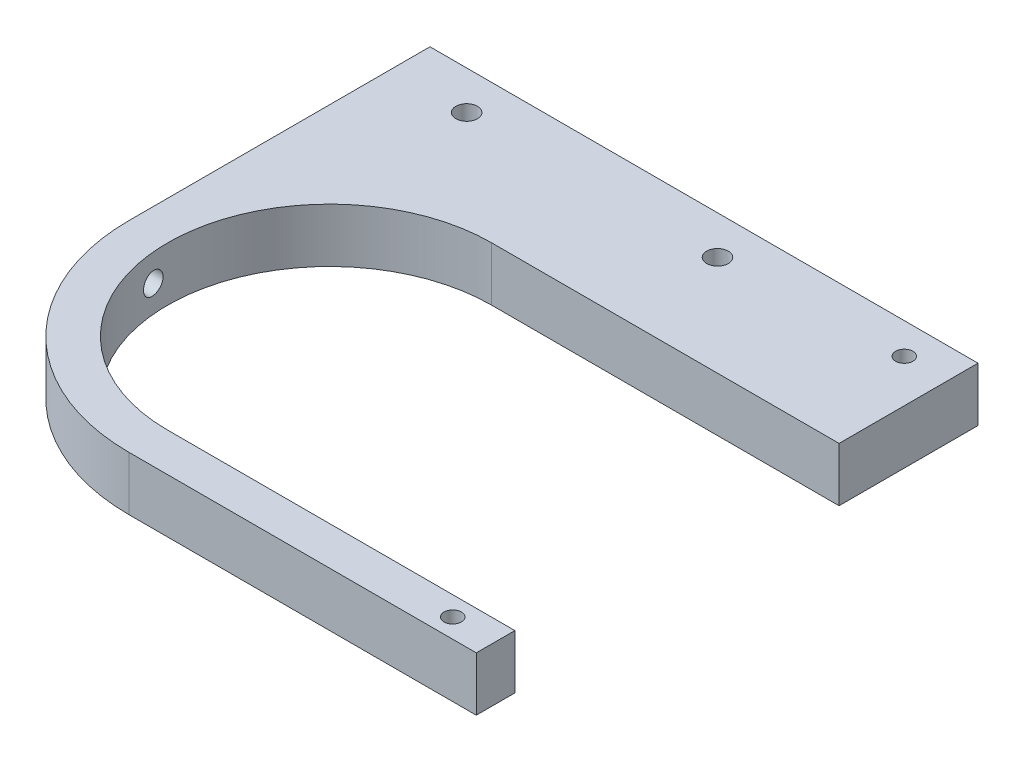
ISO-10303-21;
HEADER;
FILE_DESCRIPTION(('STEP AP214'),'2;1');
FILE_NAME('part.step','',(''),(''),'','','');
FILE_SCHEMA(('AUTOMOTIVE_DESIGN { 1 0 10303 214 1 1 1 1 }'));
ENDSEC;
DATA;
#1=APPLICATION_CONTEXT('core data for automotive mechanical design processes');
#2=APPLICATION_PROTOCOL_DEFINITION('international standard','automotive_design',2000,#1);
#3=PRODUCT_CONTEXT('',#1,'mechanical');
#4=PRODUCT('Part','Part','',(#3));
#5=PRODUCT_RELATED_PRODUCT_CATEGORY('part','',(#4));
#6=PRODUCT_DEFINITION_FORMATION('','',#4);
#7=PRODUCT_DEFINITION_CONTEXT('part definition',#1,'design');
#8=PRODUCT_DEFINITION('design','',#6,#7);
#9=PRODUCT_DEFINITION_SHAPE('','',#8);
#10=(LENGTH_UNIT() NAMED_UNIT(*) SI_UNIT(.MILLI.,.METRE.));
#11=(NAMED_UNIT(*) PLANE_ANGLE_UNIT() SI_UNIT($,.RADIAN.));
#12=(NAMED_UNIT(*) SI_UNIT($,.STERADIAN.) SOLID_ANGLE_UNIT());
#13=UNCERTAINTY_MEASURE_WITH_UNIT(LENGTH_MEASURE(1.E-05),#10,'distance_accuracy_value','');
#14=(GEOMETRIC_REPRESENTATION_CONTEXT(3) GLOBAL_UNCERTAINTY_ASSIGNED_CONTEXT((#13)) GLOBAL_UNIT_ASSIGNED_CONTEXT((#10,
#11,#12)) REPRESENTATION_CONTEXT('',''));
#15=CARTESIAN_POINT('',(0.,0.,0.));
#16=DIRECTION('',(0.,0.,1.));
#17=DIRECTION('',(1.,0.,0.));
#18=AXIS2_PLACEMENT_3D('',#15,#16,#17);
#19=CARTESIAN_POINT('',(0.,7.,0.));
#20=DIRECTION('',(0.,-1.,0.));
#21=DIRECTION('',(0.,0.,-1.));
#22=AXIS2_PLACEMENT_3D('',#19,#20,#21);
#23=CYLINDRICAL_SURFACE('',#22,21.);
#24=CARTESIAN_POINT('',(-20.7251903746368,3.5,3.38621971157564));
#25=CARTESIAN_POINT('',(-20.7251913471803,3.57796342783302,3.38621617307323));
#26=CARTESIAN_POINT('',(-20.7262614818687,3.65598157346017,3.37968411025061));
#27=CARTESIAN_POINT('',(-20.7304760100522,3.80984874992339,3.35373378688824));
#28=CARTESIAN_POINT('',(-20.7336228168622,3.88569514983167,3.3343005336295));
#29=CARTESIAN_POINT('',(-20.7417837122888,4.03295361898446,3.28315012719174));
#30=CARTESIAN_POINT('',(-20.7467962801919,4.10436924443581,3.25144297717662));
#31=CARTESIAN_POINT('',(-20.7583733047595,4.24083244334407,3.17669032323015));
#32=CARTESIAN_POINT('',(-20.7649374582461,4.30588125736108,3.13364703417879));
#33=CARTESIAN_POINT('',(-20.7792771403225,4.4283053464389,3.03710927350261));
#34=CARTESIAN_POINT('',(-20.7870609726795,4.48562259948695,2.98354246993105));
#35=CARTESIAN_POINT('',(-20.8033629311361,4.59048607000408,2.86766590992041));
#36=CARTESIAN_POINT('',(-20.8118811253355,4.63803137990189,2.80535534230596));
#37=CARTESIAN_POINT('',(-20.829294758453,4.72251772137512,2.6730085893298));
#38=CARTESIAN_POINT('',(-20.8381932573246,4.75933992218157,2.60289691695991));
#39=CARTESIAN_POINT('',(-20.855844488386,4.8206667822953,2.45746042812871));
#40=CARTESIAN_POINT('',(-20.8645972170034,4.84517114016135,2.38213548413997));
#41=CARTESIAN_POINT('',(-20.8816075718508,4.88121848847831,2.22811242356827));
#42=CARTESIAN_POINT('',(-20.8898633939771,4.8927166639148,2.14940360813372));
#43=CARTESIAN_POINT('',(-20.9055465115775,4.90223536372278,1.99109283876383));
#44=CARTESIAN_POINT('',(-20.9129738262562,4.90025620056153,1.91149090557783));
#45=CARTESIAN_POINT('',(-20.9267695521562,4.88286919128512,1.75400689402903));
#46=CARTESIAN_POINT('',(-20.9331421936006,4.86751661890114,1.67611908787106));
#47=CARTESIAN_POINT('',(-20.944768366594,4.82385549877339,1.52397577212139));
#48=CARTESIAN_POINT('',(-20.9500219325474,4.79554734941386,1.44972015091765));
#49=CARTESIAN_POINT('',(-20.9593828497396,4.72695820140345,1.30741439211239));
#50=CARTESIAN_POINT('',(-20.96349663822,4.68674721143296,1.23933092850062));
#51=CARTESIAN_POINT('',(-20.970697263797,4.59542259978396,1.1108566791854));
#52=CARTESIAN_POINT('',(-20.9737841180593,4.5443091603677,1.05046576490833));
#53=CARTESIAN_POINT('',(-20.9790572258145,4.43279498549526,0.939283756172083));
#54=CARTESIAN_POINT('',(-20.9812460785329,4.37242175904389,0.888465189256852));
#55=CARTESIAN_POINT('',(-20.9848945804997,4.24399229546418,0.797665942261616));
#56=CARTESIAN_POINT('',(-20.9863542311464,4.1759360730687,0.757685241399481));
#57=CARTESIAN_POINT('',(-20.988698355725,4.03409065743766,0.689712536197557));
#58=CARTESIAN_POINT('',(-20.9895829692353,3.96030286029556,0.661717623118196));
#59=CARTESIAN_POINT('',(-20.9909011129859,3.80907339384935,0.618499636176985));
#60=CARTESIAN_POINT('',(-20.9913346423304,3.73163171728884,0.603276587680539));
#61=CARTESIAN_POINT('',(-20.991823236802,3.57525877129235,0.586031823632448));
#62=CARTESIAN_POINT('',(-20.9918781464435,3.49632690322823,0.584015531646402));
#63=CARTESIAN_POINT('',(-20.991618987766,3.33924447574318,0.593256056009732));
#64=CARTESIAN_POINT('',(-20.9913049188839,3.26109391751493,0.604512892617455));
#65=CARTESIAN_POINT('',(-20.9902533306642,3.10778222312786,0.639981759419869));
#66=CARTESIAN_POINT('',(-20.9895157560947,3.03262147825643,0.664195479373712));
#67=CARTESIAN_POINT('',(-20.9875070539642,2.88743508273609,0.724889115546488));
#68=CARTESIAN_POINT('',(-20.9862359273903,2.81740942258874,0.761369009075825));
#69=CARTESIAN_POINT('',(-20.9830127305376,2.68449800356181,0.845543276095974));
#70=CARTESIAN_POINT('',(-20.9810608158909,2.62161061718389,0.893235085667863));
#71=CARTESIAN_POINT('',(-20.9763157189263,2.50474282453423,0.998471636092041));
#72=CARTESIAN_POINT('',(-20.9735225420564,2.45076236058522,1.05601631313664));
#73=CARTESIAN_POINT('',(-20.9669524446059,2.3532548843712,1.17928185481063));
#74=CARTESIAN_POINT('',(-20.9631759162246,2.30972371778707,1.24499945430967));
#75=CARTESIAN_POINT('',(-20.9545408260572,2.23430675237358,1.38274161288909));
#76=CARTESIAN_POINT('',(-20.9496822681237,2.202420912081,1.45476614951246));
#77=CARTESIAN_POINT('',(-20.9388525569206,2.15114996915116,1.60311713917561));
#78=CARTESIAN_POINT('',(-20.9328805515149,2.13177449188929,1.67944685560983));
#79=CARTESIAN_POINT('',(-20.9198898730644,2.10607137019401,1.83418485355518));
#80=CARTESIAN_POINT('',(-20.9128711778368,2.09974400233379,1.91259317908971));
#81=CARTESIAN_POINT('',(-20.897920325963,2.10027290504908,2.06958134192034));
#82=CARTESIAN_POINT('',(-20.8899847605712,2.10717996412416,2.14816067936248));
#83=CARTESIAN_POINT('',(-20.8734834419422,2.13404539096667,2.30298790253425));
#84=CARTESIAN_POINT('',(-20.8649176625526,2.15400430062721,2.37923569132391));
#85=CARTESIAN_POINT('',(-20.8474511812691,2.20655145084546,2.5277272881768));
#86=CARTESIAN_POINT('',(-20.8385487845881,2.23921440867713,2.59994446243285));
#87=CARTESIAN_POINT('',(-20.8208782696671,2.3162440881565,2.73785822347917));
#88=CARTESIAN_POINT('',(-20.812110150328,2.36061071394748,2.8035548636686));
#89=CARTESIAN_POINT('',(-20.7951459817752,2.45994963865638,2.92673633456874));
#90=CARTESIAN_POINT('',(-20.7869514291923,2.51494837088776,2.98420006356591));
#91=CARTESIAN_POINT('',(-20.7716258193298,2.63397246301998,3.08907393672213));
#92=CARTESIAN_POINT('',(-20.7644949904161,2.69799975549789,3.13648192297922));
#93=CARTESIAN_POINT('',(-20.7517695217233,2.83290281530044,3.2196002779026));
#94=CARTESIAN_POINT('',(-20.7461669312478,2.90374043977157,3.25537138275892));
#95=CARTESIAN_POINT('',(-20.7368120464188,3.05048441198586,3.31444255493363));
#96=CARTESIAN_POINT('',(-20.7330574283341,3.1263842570959,3.33775828741597));
#97=CARTESIAN_POINT('',(-20.7286429240355,3.25231523689511,3.36503613842597));
#98=CARTESIAN_POINT('',(-20.7273517146842,3.30149998126704,3.37296902759498));
#99=CARTESIAN_POINT('',(-20.7256251332601,3.40044904928513,3.38356192056292));
#100=CARTESIAN_POINT('',(-20.7251897535806,3.45021336777613,3.3862219712264));
#101=CARTESIAN_POINT('',(-20.7251903746368,3.5,3.38621971157564));
#102=B_SPLINE_CURVE_WITH_KNOTS('',3,(#24,#25,#26,#27,#28,#29,#30,#31,#32,#33,#34,#35,#36,#37,
#38,#39,#40,#41,#42,#43,#44,#45,#46,#47,#48,#49,#50,#51,#52,#53,#54,#55,#56,#57,#58,#59,#60,#61,
#62,#63,#64,#65,#66,#67,#68,#69,#70,#71,#72,#73,#74,#75,#76,#77,#78,#79,#80,#81,#82,#83,#84,#85,
#86,#87,#88,#89,#90,#91,#92,#93,#94,#95,#96,#97,#98,#99,#100,#101),.UNSPECIFIED.,.T.,.F.,(4,2,2,
2,2,2,2,2,2,2,2,2,2,2,2,2,2,2,2,2,2,2,2,2,2,2,2,2,2,2,2,2,2,2,2,2,2,2,4),(0.,0.233707286531613,
0.467686645297522,0.701475712187958,0.935219134695543,1.17062922389645,1.40606116698872,
1.64401064216007,1.8819659401278,2.12073867951511,2.35950588306096,2.59729089365765,
2.83506859285204,3.07147464569973,3.30787674672721,3.54358968101514,3.77930216330899,
4.01495740986626,4.25061312444261,4.48636560873954,4.72211845285831,4.9579020499474,
5.19368521089354,5.42941450576761,5.66514227410412,5.90077616853381,6.13640922397986,
6.3722233583024,6.60804249098877,6.84476841713518,7.08150417240864,7.31965384238491,
7.55780156190072,7.79654915591233,8.03534793200486,8.27287957057998,8.51011175723396,
8.6593561204268,8.80859915714277),.UNSPECIFIED.);
#103=CARTESIAN_POINT('',(-20.7251903746368,3.5,3.38621971157564));
#104=VERTEX_POINT('',#103);
#105=EDGE_CURVE('E211',#104,#104,#102,.T.);
#106=ORIENTED_EDGE('',*,*,#105,.T.);
#107=EDGE_LOOP('',(#106));
#108=FACE_BOUND('',#107,.T.);
#109=CARTESIAN_POINT('',(0.,0.,0.));
#110=DIRECTION('',(0.,-1.,0.));
#111=DIRECTION('',(0.,0.,1.));
#112=AXIS2_PLACEMENT_3D('',#109,#110,#111);
#113=CIRCLE('',#112,21.);
#114=CARTESIAN_POINT('',(0.,0.,21.));
#115=VERTEX_POINT('',#114);
#116=CARTESIAN_POINT('',(0.,0.,-21.));
#117=VERTEX_POINT('',#116);
#118=EDGE_CURVE('E141',#115,#117,#113,.T.);
#119=ORIENTED_EDGE('',*,*,#118,.T.);
#120=DIRECTION('',(0.,-1.,0.));
#121=VECTOR('',#120,1.);
#122=CARTESIAN_POINT('',(0.,7.,-21.));
#123=LINE('',#122,#121);
#124=CARTESIAN_POINT('',(0.,7.,-21.));
#125=VERTEX_POINT('',#124);
#126=EDGE_CURVE('E11',#125,#117,#123,.T.);
#127=ORIENTED_EDGE('',*,*,#126,.F.);
#128=CARTESIAN_POINT('',(0.,7.,0.));
#129=DIRECTION('',(0.,-1.,0.));
#130=DIRECTION('',(0.,0.,1.));
#131=AXIS2_PLACEMENT_3D('',#128,#129,#130);
#132=CIRCLE('',#131,21.);
#133=CARTESIAN_POINT('',(0.,7.,21.));
#134=VERTEX_POINT('',#133);
#135=EDGE_CURVE('E158',#134,#125,#132,.T.);
#136=ORIENTED_EDGE('',*,*,#135,.F.);
#137=DIRECTION('',(0.,-1.,0.));
#138=VECTOR('',#137,1.);
#139=CARTESIAN_POINT('',(0.,7.,21.));
#140=LINE('',#139,#138);
#141=EDGE_CURVE('E137',#134,#115,#140,.T.);
#142=ORIENTED_EDGE('',*,*,#141,.T.);
#143=EDGE_LOOP('',(#119,#127,#136,#142));
#144=FACE_BOUND('',#143,.T.);
#145=ADVANCED_FACE('F33',(#108,#144),#23,.F.);
#146=CARTESIAN_POINT('',(0.,7.,-21.));
#147=DIRECTION('',(0.,0.,-1.));
#148=DIRECTION('',(-1.,0.,0.));
#149=AXIS2_PLACEMENT_3D('',#146,#147,#148);
#150=PLANE('',#149);
#151=DIRECTION('',(1.,0.,0.));
#152=VECTOR('',#151,1.);
#153=CARTESIAN_POINT('',(0.,0.,-21.));
#154=LINE('',#153,#152);
#155=CARTESIAN_POINT('',(45.,0.,-21.));
#156=VERTEX_POINT('',#155);
#157=EDGE_CURVE('E144',#117,#156,#154,.T.);
#158=ORIENTED_EDGE('',*,*,#157,.T.);
#159=DIRECTION('',(0.,-1.,0.));
#160=VECTOR('',#159,1.);
#161=CARTESIAN_POINT('',(45.,7.,-21.));
#162=LINE('',#161,#160);
#163=CARTESIAN_POINT('',(45.,7.,-21.));
#164=VERTEX_POINT('',#163);
#165=EDGE_CURVE('E47',#164,#156,#162,.T.);
#166=ORIENTED_EDGE('',*,*,#165,.F.);
#167=DIRECTION('',(1.,0.,0.));
#168=VECTOR('',#167,1.);
#169=CARTESIAN_POINT('',(0.,7.,-21.));
#170=LINE('',#169,#168);
#171=EDGE_CURVE('E101',#125,#164,#170,.T.);
#172=ORIENTED_EDGE('',*,*,#171,.F.);
#173=ORIENTED_EDGE('',*,*,#126,.T.);
#174=EDGE_LOOP('',(#158,#166,#172,#173));
#175=FACE_BOUND('',#174,.T.);
#176=ADVANCED_FACE('F257',(#175),#150,.F.);
#177=CARTESIAN_POINT('',(45.,7.,-21.));
#178=DIRECTION('',(-1.,0.,0.));
#179=DIRECTION('',(0.,0.,1.));
#180=AXIS2_PLACEMENT_3D('',#177,#178,#179);
#181=PLANE('',#180);
#182=DIRECTION('',(0.,0.,-1.));
#183=VECTOR('',#182,1.);
#184=CARTESIAN_POINT('',(45.,0.,-21.));
#185=LINE('',#184,#183);
#186=CARTESIAN_POINT('',(45.,0.,-39.));
#187=VERTEX_POINT('',#186);
#188=EDGE_CURVE('E147',#156,#187,#185,.T.);
#189=ORIENTED_EDGE('',*,*,#188,.T.);
#190=DIRECTION('',(0.,-1.,0.));
#191=VECTOR('',#190,1.);
#192=CARTESIAN_POINT('',(45.,7.,-39.));
#193=LINE('',#192,#191);
#194=CARTESIAN_POINT('',(45.,7.,-39.));
#195=VERTEX_POINT('',#194);
#196=EDGE_CURVE('E168',#195,#187,#193,.T.);
#197=ORIENTED_EDGE('',*,*,#196,.F.);
#198=DIRECTION('',(0.,0.,-1.));
#199=VECTOR('',#198,1.);
#200=CARTESIAN_POINT('',(45.,7.,-21.));
#201=LINE('',#200,#199);
#202=EDGE_CURVE('E177',#164,#195,#201,.T.);
#203=ORIENTED_EDGE('',*,*,#202,.F.);
#204=ORIENTED_EDGE('',*,*,#165,.T.);
#205=EDGE_LOOP('',(#189,#197,#203,#204));
#206=FACE_BOUND('',#205,.T.);
#207=ADVANCED_FACE('F175',(#206),#181,.F.);
#208=CARTESIAN_POINT('',(45.,7.,-39.));
#209=DIRECTION('',(0.,0.,1.));
#210=DIRECTION('',(1.,0.,0.));
#211=AXIS2_PLACEMENT_3D('',#208,#209,#210);
#212=PLANE('',#211);
#213=DIRECTION('',(-1.,0.,0.));
#214=VECTOR('',#213,1.);
#215=CARTESIAN_POINT('',(45.,0.,-39.));
#216=LINE('',#215,#214);
#217=CARTESIAN_POINT('',(-26.,0.,-39.));
#218=VERTEX_POINT('',#217);
#219=EDGE_CURVE('E149',#187,#218,#216,.T.);
#220=ORIENTED_EDGE('',*,*,#219,.T.);
#221=DIRECTION('',(0.,-1.,0.));
#222=VECTOR('',#221,1.);
#223=CARTESIAN_POINT('',(-26.,7.,-39.));
#224=LINE('',#223,#222);
#225=CARTESIAN_POINT('',(-26.,7.,-39.));
#226=VERTEX_POINT('',#225);
#227=EDGE_CURVE('E165',#226,#218,#224,.T.);
#228=ORIENTED_EDGE('',*,*,#227,.F.);
#229=DIRECTION('',(-1.,0.,0.));
#230=VECTOR('',#229,1.);
#231=CARTESIAN_POINT('',(45.,7.,-39.));
#232=LINE('',#231,#230);
#233=EDGE_CURVE('E193',#195,#226,#232,.T.);
#234=ORIENTED_EDGE('',*,*,#233,.F.);
#235=ORIENTED_EDGE('',*,*,#196,.T.);
#236=EDGE_LOOP('',(#220,#228,#234,#235));
#237=FACE_BOUND('',#236,.T.);
#238=ADVANCED_FACE('F186',(#237),#212,.F.);
#239=CARTESIAN_POINT('',(-26.,7.,-39.));
#240=DIRECTION('',(1.,0.,0.));
#241=DIRECTION('',(0.,0.,-1.));
#242=AXIS2_PLACEMENT_3D('',#239,#240,#241);
#243=PLANE('',#242);
#244=DIRECTION('',(0.,0.,1.));
#245=VECTOR('',#244,1.);
#246=CARTESIAN_POINT('',(-26.,0.,-39.));
#247=LINE('',#246,#245);
#248=CARTESIAN_POINT('',(-26.,0.,0.));
#249=VERTEX_POINT('',#248);
#250=EDGE_CURVE('E151',#218,#249,#247,.T.);
#251=ORIENTED_EDGE('',*,*,#250,.T.);
#252=DIRECTION('',(0.,-1.,0.));
#253=VECTOR('',#252,1.);
#254=CARTESIAN_POINT('',(-26.,7.,0.));
#255=LINE('',#254,#253);
#256=CARTESIAN_POINT('',(-26.,7.,0.));
#257=VERTEX_POINT('',#256);
#258=EDGE_CURVE('E162',#257,#249,#255,.T.);
#259=ORIENTED_EDGE('',*,*,#258,.F.);
#260=DIRECTION('',(0.,0.,1.));
#261=VECTOR('',#260,1.);
#262=CARTESIAN_POINT('',(-26.,7.,-39.));
#263=LINE('',#262,#261);
#264=EDGE_CURVE('E192',#226,#257,#263,.T.);
#265=ORIENTED_EDGE('',*,*,#264,.F.);
#266=ORIENTED_EDGE('',*,*,#227,.T.);
#267=EDGE_LOOP('',(#251,#259,#265,#266));
#268=FACE_BOUND('',#267,.T.);
#269=ADVANCED_FACE('F190',(#268),#243,.F.);
#270=CARTESIAN_POINT('',(0.,7.,0.));
#271=DIRECTION('',(0.,-1.,0.));
#272=DIRECTION('',(0.,0.,-1.));
#273=AXIS2_PLACEMENT_3D('',#270,#271,#272);
#274=CYLINDRICAL_SURFACE('',#273,26.);
#275=CARTESIAN_POINT('',(-25.7785475941709,3.5,3.38621971157565));
#276=CARTESIAN_POINT('',(-25.7785483766418,3.42180120053282,3.38621618939366));
#277=CARTESIAN_POINT('',(-25.7794138721171,3.3435468851804,3.37964504287734));
#278=CARTESIAN_POINT('',(-25.7828233362631,3.18920671408434,3.35353356124606));
#279=CARTESIAN_POINT('',(-25.78536928071,3.11312352100758,3.33397795958713));
#280=CARTESIAN_POINT('',(-25.7919745732873,2.96539289153677,3.2824864264792));
#281=CARTESIAN_POINT('',(-25.7960328665033,2.89374240370692,3.25055912409291));
#282=CARTESIAN_POINT('',(-25.805409045951,2.75684574886473,3.17526320143853));
#283=CARTESIAN_POINT('',(-25.8107266631365,2.69159821810903,3.13189702478436));
#284=CARTESIAN_POINT('',(-25.8223315076793,2.56899511768306,3.03473122047407));
#285=CARTESIAN_POINT('',(-25.8286231645064,2.51167798693093,2.9808836251039));
#286=CARTESIAN_POINT('',(-25.8417994961178,2.40687335683891,2.86440696447606));
#287=CARTESIAN_POINT('',(-25.8486842150409,2.3593865900242,2.80177724538736));
#288=CARTESIAN_POINT('',(-25.8627296714838,2.27525719397023,2.66902470426923));
#289=CARTESIAN_POINT('',(-25.8698919921057,2.23869205446959,2.59885292865906));
#290=CARTESIAN_POINT('',(-25.884095810183,2.17787757984204,2.45334922104215));
#291=CARTESIAN_POINT('',(-25.8911373058337,2.1536284285146,2.37801721204495));
#292=CARTESIAN_POINT('',(-25.9048099525487,2.11810179039603,2.22413963226097));
#293=CARTESIAN_POINT('',(-25.9114401628081,2.10685307614408,2.14558733035552));
#294=CARTESIAN_POINT('',(-25.9240330841033,2.09776830837959,1.98765755336474));
#295=CARTESIAN_POINT('',(-25.9299958055942,2.09993204475278,1.9082800912255));
#296=CARTESIAN_POINT('',(-25.9410782653281,2.11761467465942,1.75118363504367));
#297=CARTESIAN_POINT('',(-25.9462002282477,2.13309762389078,1.67346075380371));
#298=CARTESIAN_POINT('',(-25.9555439170031,2.17695551111992,1.52168473295721));
#299=CARTESIAN_POINT('',(-25.9597656604072,2.20533019749404,1.44763152175655));
#300=CARTESIAN_POINT('',(-25.9672959173002,2.27404910741945,1.30559856826506));
#301=CARTESIAN_POINT('',(-25.9706077960816,2.31434804551426,1.23759709153424));
#302=CARTESIAN_POINT('',(-25.976403973758,2.40581832517101,1.10930899678509));
#303=CARTESIAN_POINT('',(-25.9788882817331,2.45698954743058,1.04902229412361));
#304=CARTESIAN_POINT('',(-25.9831338390139,2.56864514866346,0.937999876083232));
#305=CARTESIAN_POINT('',(-25.9848964458243,2.62911174566992,0.887246327324683));
#306=CARTESIAN_POINT('',(-25.9878335808965,2.75771281077425,0.796598551502833));
#307=CARTESIAN_POINT('',(-25.9890081098471,2.8258472698906,0.756704311719992));
#308=CARTESIAN_POINT('',(-25.9908935516404,2.96783841655858,0.688917789769116));
#309=CARTESIAN_POINT('',(-25.9916045358146,3.0416942217369,0.661023661218064));
#310=CARTESIAN_POINT('',(-25.9926627228433,3.19304138490978,0.618021916194056));
#311=CARTESIAN_POINT('',(-25.9930099252315,3.27053274756206,0.602914316103146));
#312=CARTESIAN_POINT('',(-25.9933987804093,3.42697349175572,0.58591279115545));
#313=CARTESIAN_POINT('',(-25.9934403513843,3.5059232580272,0.584022404418312));
#314=CARTESIAN_POINT('',(-25.9932252238211,3.66301991012601,0.593518414859418));
#315=CARTESIAN_POINT('',(-25.9929685249829,3.74116679514555,0.604904825394491));
#316=CARTESIAN_POINT('',(-25.9921123866061,3.89444598408974,0.640632253536637));
#317=CARTESIAN_POINT('',(-25.9915129182699,3.96957803415605,0.664974359601638));
#318=CARTESIAN_POINT('',(-25.9898819256183,4.11468697102585,0.725921068468806));
#319=CARTESIAN_POINT('',(-25.9888504018504,4.18466386436208,0.762525655731296));
#320=CARTESIAN_POINT('',(-25.9862358980087,4.31746490442398,0.846947588624285));
#321=CARTESIAN_POINT('',(-25.9846530007921,4.38029012398143,0.894763249165791));
#322=CARTESIAN_POINT('',(-25.980806142006,4.49701632920238,1.00024495229973));
#323=CARTESIAN_POINT('',(-25.9785421832247,4.55091735139989,1.05791095456473));
#324=CARTESIAN_POINT('',(-25.973217751958,4.64825597021166,1.18142815356529));
#325=CARTESIAN_POINT('',(-25.9701574858115,4.69169627179841,1.2472772276));
#326=CARTESIAN_POINT('',(-25.9631612601743,4.76690889280093,1.38528882668179));
#327=CARTESIAN_POINT('',(-25.959225303034,4.79868124353288,1.45745133478329));
#328=CARTESIAN_POINT('',(-25.950454431124,4.84968882711792,1.60606786605304));
#329=CARTESIAN_POINT('',(-25.9456190590785,4.86891766014788,1.68252405832888));
#330=CARTESIAN_POINT('',(-25.935102679967,4.89429399437154,1.83752023626909));
#331=CARTESIAN_POINT('',(-25.9294216605081,4.90044130383638,1.91606025245786));
#332=CARTESIAN_POINT('',(-25.9173310777311,4.89950815269497,2.07320415829646));
#333=CARTESIAN_POINT('',(-25.9109197124388,4.89239427890378,2.15180770914051));
#334=CARTESIAN_POINT('',(-25.8975930066555,4.86509883483279,2.30666846953665));
#335=CARTESIAN_POINT('',(-25.8906776520431,4.84491689827364,2.38292561325951));
#336=CARTESIAN_POINT('',(-25.8765985159871,4.79196264961,2.53124962372817));
#337=CARTESIAN_POINT('',(-25.8694338718932,4.75914160795969,2.60329901390306));
#338=CARTESIAN_POINT('',(-25.8552217778792,4.68184078206336,2.74085647739015));
#339=CARTESIAN_POINT('',(-25.8481743256673,4.63736122610646,2.8063646787528));
#340=CARTESIAN_POINT('',(-25.8345557029291,4.53790530075151,2.92908794699194));
#341=CARTESIAN_POINT('',(-25.827985287301,4.48291277376828,2.9862900067306));
#342=CARTESIAN_POINT('',(-25.8157053099963,4.36399539829269,3.09065178127657));
#343=CARTESIAN_POINT('',(-25.8099959431909,4.30006853408385,3.13780922379502));
#344=CARTESIAN_POINT('',(-25.7998025197506,4.16533168341433,3.22054768617938));
#345=CARTESIAN_POINT('',(-25.7953144333848,4.09454540518268,3.25616685363571));
#346=CARTESIAN_POINT('',(-25.7878256971992,3.94797315667752,3.31495590459171));
#347=CARTESIAN_POINT('',(-25.7848232105121,3.87219349257375,3.33814116496729));
#348=CARTESIAN_POINT('',(-25.7812990748232,3.74660359593704,3.36522225220424));
#349=CARTESIAN_POINT('',(-25.7802699859931,3.69762737865138,3.37308581057756));
#350=CARTESIAN_POINT('',(-25.7788939996098,3.59910820659255,3.38358564177872));
#351=CARTESIAN_POINT('',(-25.7785470982123,3.54956525501462,3.38622194406322));
#352=CARTESIAN_POINT('',(-25.7785475941709,3.5,3.38621971157565));
#353=B_SPLINE_CURVE_WITH_KNOTS('',3,(#275,#276,#277,#278,#279,#280,#281,#282,#283,#284,#285,
#286,#287,#288,#289,#290,#291,#292,#293,#294,#295,#296,#297,#298,#299,#300,#301,#302,#303,#304,
#305,#306,#307,#308,#309,#310,#311,#312,#313,#314,#315,#316,#317,#318,#319,#320,#321,#322,#323,
#324,#325,#326,#327,#328,#329,#330,#331,#332,#333,#334,#335,#336,#337,#338,#339,#340,#341,#342,
#343,#344,#345,#346,#347,#348,#349,#350,#351,#352),.UNSPECIFIED.,.T.,.F.,(4,2,2,2,2,2,2,2,2,2,2,
2,2,2,2,2,2,2,2,2,2,2,2,2,2,2,2,2,2,2,2,2,2,2,2,2,2,2,4),(0.,0.234414665918658,
0.469105435369621,0.703632805566987,0.938110115692735,1.1736868605148,1.40928115339831,
1.646509329678,1.88374104616337,2.12149680395719,2.35924883717077,2.59636125921099,
2.83346905343921,3.06968768033945,3.30590371532922,3.54167336880475,3.77744274612143,
4.01317583407418,4.24890922404674,4.48470571514319,4.72050244345769,4.95631898509213,
5.19213522788829,5.4279160488391,5.66369590452336,5.89941472573769,6.13513291428998,
6.37097127465537,6.6068130915533,6.84324994429534,7.07969342431532,7.31705777968598,
7.55441748749585,7.79214497422779,8.02992618258459,8.26691302416587,8.50360610690051,
8.65218752054895,8.80076809690809),.UNSPECIFIED.);
#354=CARTESIAN_POINT('',(-25.7785475941709,3.5,3.38621971157565));
#355=VERTEX_POINT('',#354);
#356=EDGE_CURVE('E37',#355,#355,#353,.T.);
#357=ORIENTED_EDGE('',*,*,#356,.T.);
#358=EDGE_LOOP('',(#357));
#359=FACE_BOUND('',#358,.T.);
#360=CARTESIAN_POINT('',(0.,0.,0.));
#361=DIRECTION('',(0.,1.,0.));
#362=DIRECTION('',(0.,0.,1.));
#363=AXIS2_PLACEMENT_3D('',#360,#361,#362);
#364=CIRCLE('',#363,26.);
#365=CARTESIAN_POINT('',(0.,0.,26.));
#366=VERTEX_POINT('',#365);
#367=EDGE_CURVE('E153',#249,#366,#364,.T.);
#368=ORIENTED_EDGE('',*,*,#367,.T.);
#369=DIRECTION('',(0.,-1.,0.));
#370=VECTOR('',#369,1.);
#371=CARTESIAN_POINT('',(0.,7.,26.));
#372=LINE('',#371,#370);
#373=CARTESIAN_POINT('',(0.,7.,26.));
#374=VERTEX_POINT('',#373);
#375=EDGE_CURVE('E132',#374,#366,#372,.T.);
#376=ORIENTED_EDGE('',*,*,#375,.F.);
#377=CARTESIAN_POINT('',(0.,7.,0.));
#378=DIRECTION('',(0.,1.,0.));
#379=DIRECTION('',(0.,0.,1.));
#380=AXIS2_PLACEMENT_3D('',#377,#378,#379);
#381=CIRCLE('',#380,26.);
#382=EDGE_CURVE('E123',#257,#374,#381,.T.);
#383=ORIENTED_EDGE('',*,*,#382,.F.);
#384=ORIENTED_EDGE('',*,*,#258,.T.);
#385=EDGE_LOOP('',(#368,#376,#383,#384));
#386=FACE_BOUND('',#385,.T.);
#387=ADVANCED_FACE('F247',(#359,#386),#274,.T.);
#388=CARTESIAN_POINT('',(0.,7.,26.));
#389=DIRECTION('',(0.,0.,-1.));
#390=DIRECTION('',(-1.,0.,0.));
#391=AXIS2_PLACEMENT_3D('',#388,#389,#390);
#392=PLANE('',#391);
#393=DIRECTION('',(1.,0.,0.));
#394=VECTOR('',#393,1.);
#395=CARTESIAN_POINT('',(0.,0.,26.));
#396=LINE('',#395,#394);
#397=CARTESIAN_POINT('',(45.,0.,26.));
#398=VERTEX_POINT('',#397);
#399=EDGE_CURVE('E131',#366,#398,#396,.T.);
#400=ORIENTED_EDGE('',*,*,#399,.T.);
#401=DIRECTION('',(0.,-1.,0.));
#402=VECTOR('',#401,1.);
#403=CARTESIAN_POINT('',(45.,7.,26.));
#404=LINE('',#403,#402);
#405=CARTESIAN_POINT('',(45.,7.,26.));
#406=VERTEX_POINT('',#405);
#407=EDGE_CURVE('E128',#406,#398,#404,.T.);
#408=ORIENTED_EDGE('',*,*,#407,.F.);
#409=DIRECTION('',(1.,0.,0.));
#410=VECTOR('',#409,1.);
#411=CARTESIAN_POINT('',(0.,7.,26.));
#412=LINE('',#411,#410);
#413=EDGE_CURVE('E117',#374,#406,#412,.T.);
#414=ORIENTED_EDGE('',*,*,#413,.F.);
#415=ORIENTED_EDGE('',*,*,#375,.T.);
#416=EDGE_LOOP('',(#400,#408,#414,#415));
#417=FACE_BOUND('',#416,.T.);
#418=ADVANCED_FACE('F129',(#417),#392,.F.);
#419=CARTESIAN_POINT('',(45.,7.,26.));
#420=DIRECTION('',(-1.,0.,0.));
#421=DIRECTION('',(0.,0.,1.));
#422=AXIS2_PLACEMENT_3D('',#419,#420,#421);
#423=PLANE('',#422);
#424=DIRECTION('',(0.,0.,-1.));
#425=VECTOR('',#424,1.);
#426=CARTESIAN_POINT('',(45.,0.,26.));
#427=LINE('',#426,#425);
#428=CARTESIAN_POINT('',(45.,0.,21.));
#429=VERTEX_POINT('',#428);
#430=EDGE_CURVE('E87',#398,#429,#427,.T.);
#431=ORIENTED_EDGE('',*,*,#430,.T.);
#432=DIRECTION('',(0.,-1.,0.));
#433=VECTOR('',#432,1.);
#434=CARTESIAN_POINT('',(45.,7.,21.));
#435=LINE('',#434,#433);
#436=CARTESIAN_POINT('',(45.,7.,21.));
#437=VERTEX_POINT('',#436);
#438=EDGE_CURVE('E133',#437,#429,#435,.T.);
#439=ORIENTED_EDGE('',*,*,#438,.F.);
#440=DIRECTION('',(0.,0.,-1.));
#441=VECTOR('',#440,1.);
#442=CARTESIAN_POINT('',(45.,7.,26.));
#443=LINE('',#442,#441);
#444=EDGE_CURVE('E121',#406,#437,#443,.T.);
#445=ORIENTED_EDGE('',*,*,#444,.F.);
#446=ORIENTED_EDGE('',*,*,#407,.T.);
#447=EDGE_LOOP('',(#431,#439,#445,#446));
#448=FACE_BOUND('',#447,.T.);
#449=ADVANCED_FACE('F135',(#448),#423,.F.);
#450=CARTESIAN_POINT('',(0.,7.,21.));
#451=DIRECTION('',(0.,0.,1.));
#452=DIRECTION('',(1.,0.,0.));
#453=AXIS2_PLACEMENT_3D('',#450,#451,#452);
#454=PLANE('',#453);
#455=DIRECTION('',(-1.,0.,0.));
#456=VECTOR('',#455,1.);
#457=CARTESIAN_POINT('',(0.,0.,21.));
#458=LINE('',#457,#456);
#459=EDGE_CURVE('E93',#429,#115,#458,.T.);
#460=ORIENTED_EDGE('',*,*,#459,.T.);
#461=ORIENTED_EDGE('',*,*,#141,.F.);
#462=DIRECTION('',(-1.,0.,0.));
#463=VECTOR('',#462,1.);
#464=CARTESIAN_POINT('',(0.,7.,21.));
#465=LINE('',#464,#463);
#466=EDGE_CURVE('E55',#437,#134,#465,.T.);
#467=ORIENTED_EDGE('',*,*,#466,.F.);
#468=ORIENTED_EDGE('',*,*,#438,.T.);
#469=EDGE_LOOP('',(#460,#461,#467,#468));
#470=FACE_BOUND('',#469,.T.);
#471=ADVANCED_FACE('F237',(#470),#454,.F.);
#472=CARTESIAN_POINT('',(0.,7.,0.));
#473=DIRECTION('',(0.,1.,0.));
#474=DIRECTION('',(0.,0.,1.));
#475=AXIS2_PLACEMENT_3D('',#472,#473,#474);
#476=PLANE('',#475);
#477=CARTESIAN_POINT('',(-16.25,7.,-34.));
#478=DIRECTION('',(0.,1.,0.));
#479=DIRECTION('',(0.,0.,1.));
#480=AXIS2_PLACEMENT_3D('',#477,#478,#479);
#481=CIRCLE('',#480,1.4);
#482=CARTESIAN_POINT('',(-16.25,7.,-32.6));
#483=VERTEX_POINT('',#482);
#484=EDGE_CURVE('E331',#483,#483,#481,.T.);
#485=ORIENTED_EDGE('',*,*,#484,.F.);
#486=EDGE_LOOP('',(#485));
#487=FACE_BOUND('',#486,.T.);
#488=CARTESIAN_POINT('',(16.25,7.,-34.));
#489=DIRECTION('',(0.,1.,0.));
#490=DIRECTION('',(0.,0.,1.));
#491=AXIS2_PLACEMENT_3D('',#488,#489,#490);
#492=CIRCLE('',#491,1.4);
#493=CARTESIAN_POINT('',(16.25,7.,-32.6));
#494=VERTEX_POINT('',#493);
#495=EDGE_CURVE('E216',#494,#494,#492,.T.);
#496=ORIENTED_EDGE('',*,*,#495,.F.);
#497=EDGE_LOOP('',(#496));
#498=FACE_BOUND('',#497,.T.);
#499=CARTESIAN_POINT('',(39.4457939001427,7.,23.5));
#500=DIRECTION('',(0.,1.,0.));
#501=DIRECTION('',(0.,0.,1.));
#502=AXIS2_PLACEMENT_3D('',#499,#500,#501);
#503=CIRCLE('',#502,1.125);
#504=CARTESIAN_POINT('',(39.4457939001427,7.,24.625));
#505=VERTEX_POINT('',#504);
#506=EDGE_CURVE('E205',#505,#505,#503,.T.);
#507=ORIENTED_EDGE('',*,*,#506,.F.);
#508=EDGE_LOOP('',(#507));
#509=FACE_BOUND('',#508,.T.);
#510=CARTESIAN_POINT('',(39.4457939001427,7.,-35.));
#511=DIRECTION('',(0.,1.,0.));
#512=DIRECTION('',(0.,0.,1.));
#513=AXIS2_PLACEMENT_3D('',#510,#511,#512);
#514=CIRCLE('',#513,1.125);
#515=CARTESIAN_POINT('',(39.4457939001427,7.,-33.875));
#516=VERTEX_POINT('',#515);
#517=EDGE_CURVE('E145',#516,#516,#514,.T.);
#518=ORIENTED_EDGE('',*,*,#517,.F.);
#519=EDGE_LOOP('',(#518));
#520=FACE_BOUND('',#519,.T.);
#521=ORIENTED_EDGE('',*,*,#135,.T.);
#522=ORIENTED_EDGE('',*,*,#171,.T.);
#523=ORIENTED_EDGE('',*,*,#202,.T.);
#524=ORIENTED_EDGE('',*,*,#233,.T.);
#525=ORIENTED_EDGE('',*,*,#264,.T.);
#526=ORIENTED_EDGE('',*,*,#382,.T.);
#527=ORIENTED_EDGE('',*,*,#413,.T.);
#528=ORIENTED_EDGE('',*,*,#444,.T.);
#529=ORIENTED_EDGE('',*,*,#466,.T.);
#530=EDGE_LOOP('',(#521,#522,#523,#524,#525,#526,#527,#528,#529));
#531=FACE_BOUND('',#530,.T.);
#532=ADVANCED_FACE('F119',(#487,#498,#509,#520,#531),#476,.T.);
#533=CARTESIAN_POINT('',(0.,0.,0.));
#534=DIRECTION('',(0.,1.,0.));
#535=DIRECTION('',(0.,0.,1.));
#536=AXIS2_PLACEMENT_3D('',#533,#534,#535);
#537=PLANE('',#536);
#538=CARTESIAN_POINT('',(-16.25,0.,-34.));
#539=DIRECTION('',(0.,1.,0.));
#540=DIRECTION('',(0.,0.,1.));
#541=AXIS2_PLACEMENT_3D('',#538,#539,#540);
#542=CIRCLE('',#541,1.4);
#543=CARTESIAN_POINT('',(-16.25,0.,-32.6));
#544=VERTEX_POINT('',#543);
#545=EDGE_CURVE('E328',#544,#544,#542,.T.);
#546=ORIENTED_EDGE('',*,*,#545,.T.);
#547=EDGE_LOOP('',(#546));
#548=FACE_BOUND('',#547,.T.);
#549=CARTESIAN_POINT('',(16.25,0.,-34.));
#550=DIRECTION('',(0.,1.,0.));
#551=DIRECTION('',(0.,0.,1.));
#552=AXIS2_PLACEMENT_3D('',#549,#550,#551);
#553=CIRCLE('',#552,1.4);
#554=CARTESIAN_POINT('',(16.25,0.,-32.6));
#555=VERTEX_POINT('',#554);
#556=EDGE_CURVE('E334',#555,#555,#553,.T.);
#557=ORIENTED_EDGE('',*,*,#556,.T.);
#558=EDGE_LOOP('',(#557));
#559=FACE_BOUND('',#558,.T.);
#560=CARTESIAN_POINT('',(39.4457939001427,0.,23.5));
#561=DIRECTION('',(0.,1.,0.));
#562=DIRECTION('',(0.,0.,1.));
#563=AXIS2_PLACEMENT_3D('',#560,#561,#562);
#564=CIRCLE('',#563,1.125);
#565=CARTESIAN_POINT('',(39.4457939001427,0.,24.625));
#566=VERTEX_POINT('',#565);
#567=EDGE_CURVE('E208',#566,#566,#564,.T.);
#568=ORIENTED_EDGE('',*,*,#567,.T.);
#569=EDGE_LOOP('',(#568));
#570=FACE_BOUND('',#569,.T.);
#571=CARTESIAN_POINT('',(39.4457939001427,0.,-35.));
#572=DIRECTION('',(0.,1.,0.));
#573=DIRECTION('',(0.,0.,1.));
#574=AXIS2_PLACEMENT_3D('',#571,#572,#573);
#575=CIRCLE('',#574,1.125);
#576=CARTESIAN_POINT('',(39.4457939001427,0.,-33.875));
#577=VERTEX_POINT('',#576);
#578=EDGE_CURVE('E202',#577,#577,#575,.T.);
#579=ORIENTED_EDGE('',*,*,#578,.T.);
#580=EDGE_LOOP('',(#579));
#581=FACE_BOUND('',#580,.T.);
#582=ORIENTED_EDGE('',*,*,#118,.F.);
#583=ORIENTED_EDGE('',*,*,#459,.F.);
#584=ORIENTED_EDGE('',*,*,#430,.F.);
#585=ORIENTED_EDGE('',*,*,#399,.F.);
#586=ORIENTED_EDGE('',*,*,#367,.F.);
#587=ORIENTED_EDGE('',*,*,#250,.F.);
#588=ORIENTED_EDGE('',*,*,#219,.F.);
#589=ORIENTED_EDGE('',*,*,#188,.F.);
#590=ORIENTED_EDGE('',*,*,#157,.F.);
#591=EDGE_LOOP('',(#582,#583,#584,#585,#586,#587,#588,#589,#590));
#592=FACE_BOUND('',#591,.T.);
#593=ADVANCED_FACE('F181',(#548,#559,#570,#581,#592),#537,.F.);
#594=CARTESIAN_POINT('',(39.4457939001427,0.,-35.));
#595=DIRECTION('',(0.,1.,0.));
#596=DIRECTION('',(0.,0.,1.));
#597=AXIS2_PLACEMENT_3D('',#594,#595,#596);
#598=CYLINDRICAL_SURFACE('',#597,1.125);
#599=ORIENTED_EDGE('',*,*,#517,.T.);
#600=EDGE_LOOP('',(#599));
#601=FACE_BOUND('',#600,.T.);
#602=ORIENTED_EDGE('',*,*,#578,.F.);
#603=EDGE_LOOP('',(#602));
#604=FACE_BOUND('',#603,.T.);
#605=ADVANCED_FACE('F230',(#601,#604),#598,.F.);
#606=CARTESIAN_POINT('',(39.4457939001427,0.,23.5));
#607=DIRECTION('',(0.,1.,0.));
#608=DIRECTION('',(0.,0.,1.));
#609=AXIS2_PLACEMENT_3D('',#606,#607,#608);
#610=CYLINDRICAL_SURFACE('',#609,1.125);
#611=ORIENTED_EDGE('',*,*,#506,.T.);
#612=EDGE_LOOP('',(#611));
#613=FACE_BOUND('',#612,.T.);
#614=ORIENTED_EDGE('',*,*,#567,.F.);
#615=EDGE_LOOP('',(#614));
#616=FACE_BOUND('',#615,.T.);
#617=ADVANCED_FACE('F224',(#613,#616),#610,.F.);
#618=CARTESIAN_POINT('',(45.,3.5,1.98621971157564));
#619=DIRECTION('',(-1.,0.,0.));
#620=DIRECTION('',(0.,0.,1.));
#621=AXIS2_PLACEMENT_3D('',#618,#619,#620);
#622=CYLINDRICAL_SURFACE('',#621,1.4);
#623=ORIENTED_EDGE('',*,*,#356,.F.);
#624=EDGE_LOOP('',(#623));
#625=FACE_BOUND('',#624,.T.);
#626=ORIENTED_EDGE('',*,*,#105,.F.);
#627=EDGE_LOOP('',(#626));
#628=FACE_BOUND('',#627,.T.);
#629=ADVANCED_FACE('F218',(#625,#628),#622,.F.);
#630=CARTESIAN_POINT('',(16.25,0.,-34.));
#631=DIRECTION('',(0.,1.,0.));
#632=DIRECTION('',(0.,0.,1.));
#633=AXIS2_PLACEMENT_3D('',#630,#631,#632);
#634=CYLINDRICAL_SURFACE('',#633,1.4);
#635=ORIENTED_EDGE('',*,*,#556,.F.);
#636=EDGE_LOOP('',(#635));
#637=FACE_BOUND('',#636,.T.);
#638=ORIENTED_EDGE('',*,*,#495,.T.);
#639=EDGE_LOOP('',(#638));
#640=FACE_BOUND('',#639,.T.);
#641=ADVANCED_FACE('F223',(#637,#640),#634,.F.);
#642=CARTESIAN_POINT('',(-16.25,0.,-34.));
#643=DIRECTION('',(0.,1.,0.));
#644=DIRECTION('',(0.,0.,1.));
#645=AXIS2_PLACEMENT_3D('',#642,#643,#644);
#646=CYLINDRICAL_SURFACE('',#645,1.4);
#647=ORIENTED_EDGE('',*,*,#545,.F.);
#648=EDGE_LOOP('',(#647));
#649=FACE_BOUND('',#648,.T.);
#650=ORIENTED_EDGE('',*,*,#484,.T.);
#651=EDGE_LOOP('',(#650));
#652=FACE_BOUND('',#651,.T.);
#653=ADVANCED_FACE('F313',(#649,#652),#646,.F.);
#654=CLOSED_SHELL('',(#145,#176,#207,#238,#269,#387,#418,#449,#471,#532,#593,#605,#617,#629,
#641,#653));
#655=MANIFOLD_SOLID_BREP('B2',#654);
#656=ADVANCED_BREP_SHAPE_REPRESENTATION('',(#18,#655),#14);
#657=SHAPE_DEFINITION_REPRESENTATION(#9,#656);
ENDSEC;
END-ISO-10303-21;
